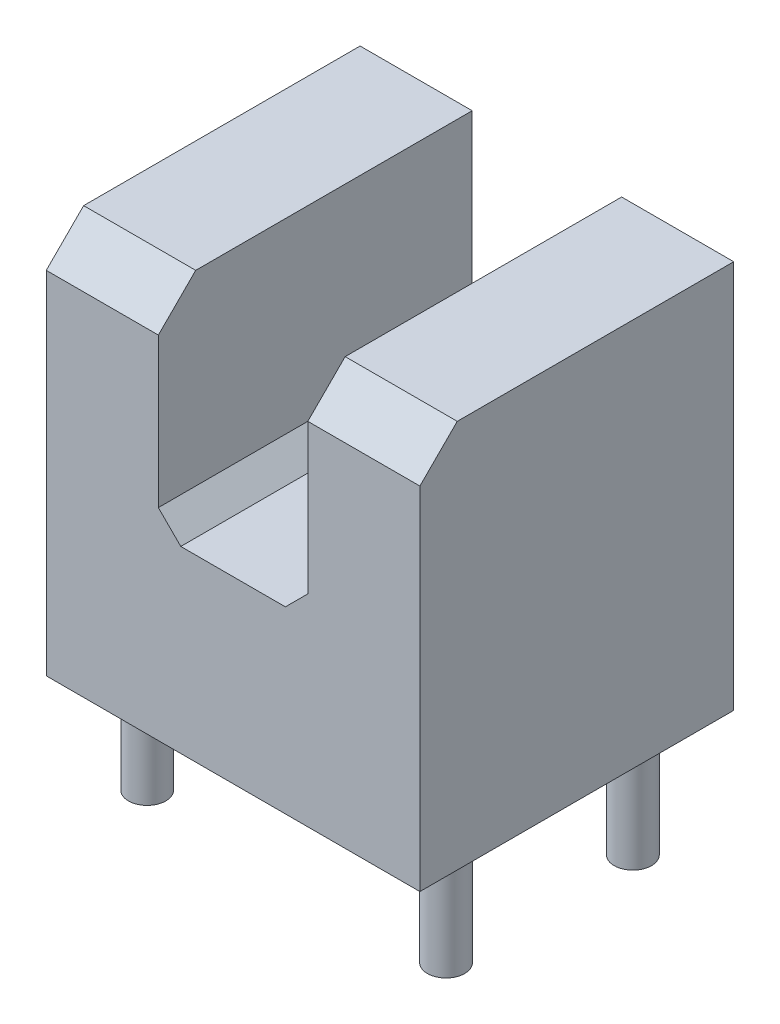
ISO-10303-21;
HEADER;
FILE_DESCRIPTION(('STEP AP214'),'2;1');
FILE_NAME('part.step','',(''),(''),'','','');
FILE_SCHEMA(('AUTOMOTIVE_DESIGN { 1 0 10303 214 1 1 1 1 }'));
ENDSEC;
DATA;
#1=APPLICATION_CONTEXT('core data for automotive mechanical design processes');
#2=APPLICATION_PROTOCOL_DEFINITION('international standard','automotive_design',2000,#1);
#3=PRODUCT_CONTEXT('',#1,'mechanical');
#4=PRODUCT('Part','Part','',(#3));
#5=PRODUCT_RELATED_PRODUCT_CATEGORY('part','',(#4));
#6=PRODUCT_DEFINITION_FORMATION('','',#4);
#7=PRODUCT_DEFINITION_CONTEXT('part definition',#1,'design');
#8=PRODUCT_DEFINITION('design','',#6,#7);
#9=PRODUCT_DEFINITION_SHAPE('','',#8);
#10=(LENGTH_UNIT() NAMED_UNIT(*) SI_UNIT(.MILLI.,.METRE.));
#11=(NAMED_UNIT(*) PLANE_ANGLE_UNIT() SI_UNIT($,.RADIAN.));
#12=(NAMED_UNIT(*) SI_UNIT($,.STERADIAN.) SOLID_ANGLE_UNIT());
#13=UNCERTAINTY_MEASURE_WITH_UNIT(LENGTH_MEASURE(1.E-05),#10,'distance_accuracy_value','');
#14=(GEOMETRIC_REPRESENTATION_CONTEXT(3) GLOBAL_UNCERTAINTY_ASSIGNED_CONTEXT((#13)) GLOBAL_UNIT_ASSIGNED_CONTEXT((#10,
#11,#12)) REPRESENTATION_CONTEXT('',''));
#15=CARTESIAN_POINT('',(0.,0.,0.));
#16=DIRECTION('',(0.,0.,1.));
#17=DIRECTION('',(1.,0.,0.));
#18=AXIS2_PLACEMENT_3D('',#15,#16,#17);
#19=CARTESIAN_POINT('',(0.,2.4,0.));
#20=DIRECTION('',(0.,-1.,0.));
#21=DIRECTION('',(0.,0.,-1.));
#22=AXIS2_PLACEMENT_3D('',#19,#20,#21);
#23=PLANE('',#22);
#24=DIRECTION('',(1.,0.,0.));
#25=VECTOR('',#24,1.);
#26=CARTESIAN_POINT('',(0.,2.4,2.1));
#27=LINE('',#26,#25);
#28=CARTESIAN_POINT('',(-0.7,2.4,2.1));
#29=VERTEX_POINT('',#28);
#30=CARTESIAN_POINT('',(0.7,2.4,2.1));
#31=VERTEX_POINT('',#30);
#32=EDGE_CURVE('E108',#29,#31,#27,.T.);
#33=ORIENTED_EDGE('',*,*,#32,.T.);
#34=DIRECTION('',(0.,0.,1.));
#35=VECTOR('',#34,1.);
#36=CARTESIAN_POINT('',(0.7,2.4,-2.1));
#37=LINE('',#36,#35);
#38=CARTESIAN_POINT('',(0.7,2.4,-2.1));
#39=VERTEX_POINT('',#38);
#40=EDGE_CURVE('E218',#39,#31,#37,.T.);
#41=ORIENTED_EDGE('',*,*,#40,.F.);
#42=DIRECTION('',(1.,0.,0.));
#43=VECTOR('',#42,1.);
#44=CARTESIAN_POINT('',(0.,2.4,-2.1));
#45=LINE('',#44,#43);
#46=CARTESIAN_POINT('',(-0.7,2.4,-2.1));
#47=VERTEX_POINT('',#46);
#48=EDGE_CURVE('E103',#39,#47,#45,.F.);
#49=ORIENTED_EDGE('',*,*,#48,.T.);
#50=DIRECTION('',(0.,0.,1.));
#51=VECTOR('',#50,1.);
#52=CARTESIAN_POINT('',(-0.7,2.4,-2.1));
#53=LINE('',#52,#51);
#54=EDGE_CURVE('E119',#29,#47,#53,.F.);
#55=ORIENTED_EDGE('',*,*,#54,.F.);
#56=EDGE_LOOP('',(#33,#41,#49,#55));
#57=FACE_BOUND('',#56,.T.);
#58=ADVANCED_FACE('F16',(#57),#23,.F.);
#59=CARTESIAN_POINT('',(-1.,2.7,-2.1));
#60=DIRECTION('',(0.707106781186548,0.707106781186548,0.));
#61=DIRECTION('',(-0.707106781186548,0.707106781186548,0.));
#62=AXIS2_PLACEMENT_3D('',#59,#60,#61);
#63=PLANE('',#62);
#64=DIRECTION('',(-0.707106781186548,0.707106781186548,0.));
#65=VECTOR('',#64,1.);
#66=CARTESIAN_POINT('',(-1.,2.7,-2.1));
#67=LINE('',#66,#65);
#68=CARTESIAN_POINT('',(-1.,2.7,-2.1));
#69=VERTEX_POINT('',#68);
#70=EDGE_CURVE('E121',#47,#69,#67,.T.);
#71=ORIENTED_EDGE('',*,*,#70,.T.);
#72=DIRECTION('',(0.,0.,1.));
#73=VECTOR('',#72,1.);
#74=CARTESIAN_POINT('',(-1.,2.7,-2.1));
#75=LINE('',#74,#73);
#76=CARTESIAN_POINT('',(-1.,2.7,2.1));
#77=VERTEX_POINT('',#76);
#78=EDGE_CURVE('E125',#77,#69,#75,.F.);
#79=ORIENTED_EDGE('',*,*,#78,.F.);
#80=DIRECTION('',(-0.707106781186548,0.707106781186548,0.));
#81=VECTOR('',#80,1.);
#82=CARTESIAN_POINT('',(-1.,2.7,2.1));
#83=LINE('',#82,#81);
#84=EDGE_CURVE('E112',#77,#29,#83,.F.);
#85=ORIENTED_EDGE('',*,*,#84,.T.);
#86=ORIENTED_EDGE('',*,*,#54,.T.);
#87=EDGE_LOOP('',(#71,#79,#85,#86));
#88=FACE_BOUND('',#87,.T.);
#89=ADVANCED_FACE('F123',(#88),#63,.T.);
#90=CARTESIAN_POINT('',(1.,2.7,-2.1));
#91=DIRECTION('',(-0.707106781186548,0.707106781186548,0.));
#92=DIRECTION('',(-0.707106781186548,-0.707106781186548,0.));
#93=AXIS2_PLACEMENT_3D('',#90,#91,#92);
#94=PLANE('',#93);
#95=DIRECTION('',(-0.707106781186548,-0.707106781186548,0.));
#96=VECTOR('',#95,1.);
#97=CARTESIAN_POINT('',(1.,2.7,2.1));
#98=LINE('',#97,#96);
#99=CARTESIAN_POINT('',(1.,2.7,2.1));
#100=VERTEX_POINT('',#99);
#101=EDGE_CURVE('E115',#31,#100,#98,.F.);
#102=ORIENTED_EDGE('',*,*,#101,.T.);
#103=DIRECTION('',(0.,0.,-1.));
#104=VECTOR('',#103,1.);
#105=CARTESIAN_POINT('',(1.,2.7,-2.1));
#106=LINE('',#105,#104);
#107=CARTESIAN_POINT('',(1.,2.7,-2.1));
#108=VERTEX_POINT('',#107);
#109=EDGE_CURVE('E192',#108,#100,#106,.F.);
#110=ORIENTED_EDGE('',*,*,#109,.F.);
#111=DIRECTION('',(-0.707106781186548,-0.707106781186548,0.));
#112=VECTOR('',#111,1.);
#113=CARTESIAN_POINT('',(1.,2.7,-2.1));
#114=LINE('',#113,#112);
#115=EDGE_CURVE('E220',#108,#39,#114,.T.);
#116=ORIENTED_EDGE('',*,*,#115,.T.);
#117=ORIENTED_EDGE('',*,*,#40,.T.);
#118=EDGE_LOOP('',(#102,#110,#116,#117));
#119=FACE_BOUND('',#118,.T.);
#120=ADVANCED_FACE('F260',(#119),#94,.T.);
#121=CARTESIAN_POINT('',(0.,5.2,0.));
#122=DIRECTION('',(0.,-1.,0.));
#123=DIRECTION('',(0.,0.,-1.));
#124=AXIS2_PLACEMENT_3D('',#121,#122,#123);
#125=PLANE('',#124);
#126=DIRECTION('',(0.,0.,1.));
#127=VECTOR('',#126,1.);
#128=CARTESIAN_POINT('',(2.5,5.2,2.1));
#129=LINE('',#128,#127);
#130=CARTESIAN_POINT('',(2.5,5.2,-2.1));
#131=VERTEX_POINT('',#130);
#132=CARTESIAN_POINT('',(2.5,5.2,1.6));
#133=VERTEX_POINT('',#132);
#134=EDGE_CURVE('E189',#131,#133,#129,.T.);
#135=ORIENTED_EDGE('',*,*,#134,.F.);
#136=DIRECTION('',(1.,0.,0.));
#137=VECTOR('',#136,1.);
#138=CARTESIAN_POINT('',(0.,5.2,-2.1));
#139=LINE('',#138,#137);
#140=CARTESIAN_POINT('',(1.,5.2,-2.1));
#141=VERTEX_POINT('',#140);
#142=EDGE_CURVE('E215',#131,#141,#139,.F.);
#143=ORIENTED_EDGE('',*,*,#142,.T.);
#144=DIRECTION('',(0.,0.,-1.));
#145=VECTOR('',#144,1.);
#146=CARTESIAN_POINT('',(1.,5.2,-2.1));
#147=LINE('',#146,#145);
#148=CARTESIAN_POINT('',(1.,5.2,1.6));
#149=VERTEX_POINT('',#148);
#150=EDGE_CURVE('E195',#149,#141,#147,.T.);
#151=ORIENTED_EDGE('',*,*,#150,.F.);
#152=DIRECTION('',(1.,0.,0.));
#153=VECTOR('',#152,1.);
#154=CARTESIAN_POINT('',(0.,5.2,1.6));
#155=LINE('',#154,#153);
#156=EDGE_CURVE('E213',#133,#149,#155,.F.);
#157=ORIENTED_EDGE('',*,*,#156,.F.);
#158=EDGE_LOOP('',(#135,#143,#151,#157));
#159=FACE_BOUND('',#158,.T.);
#160=ADVANCED_FACE('F262',(#159),#125,.F.);
#161=CARTESIAN_POINT('',(0.,5.2,1.6));
#162=DIRECTION('',(0.,-0.707106781186548,-0.707106781186548));
#163=DIRECTION('',(0.,0.707106781186548,-0.707106781186548));
#164=AXIS2_PLACEMENT_3D('',#161,#162,#163);
#165=PLANE('',#164);
#166=DIRECTION('',(0.,-0.707106781186548,0.707106781186547));
#167=VECTOR('',#166,1.);
#168=CARTESIAN_POINT('',(2.5,5.2,1.6));
#169=LINE('',#168,#167);
#170=CARTESIAN_POINT('',(2.5,4.7,2.1));
#171=VERTEX_POINT('',#170);
#172=EDGE_CURVE('E187',#133,#171,#169,.T.);
#173=ORIENTED_EDGE('',*,*,#172,.F.);
#174=ORIENTED_EDGE('',*,*,#156,.T.);
#175=DIRECTION('',(0.,0.707106781186547,-0.707106781186547));
#176=VECTOR('',#175,1.);
#177=CARTESIAN_POINT('',(1.,4.7,2.1));
#178=LINE('',#177,#176);
#179=CARTESIAN_POINT('',(1.,4.7,2.1));
#180=VERTEX_POINT('',#179);
#181=EDGE_CURVE('E198',#180,#149,#178,.T.);
#182=ORIENTED_EDGE('',*,*,#181,.F.);
#183=DIRECTION('',(-1.,0.,0.));
#184=VECTOR('',#183,1.);
#185=CARTESIAN_POINT('',(-2.5,4.7,2.1));
#186=LINE('',#185,#184);
#187=EDGE_CURVE('E181',#171,#180,#186,.T.);
#188=ORIENTED_EDGE('',*,*,#187,.F.);
#189=EDGE_LOOP('',(#173,#174,#182,#188));
#190=FACE_BOUND('',#189,.T.);
#191=ADVANCED_FACE('F252',(#190),#165,.F.);
#192=CARTESIAN_POINT('',(0.,5.2,1.6));
#193=DIRECTION('',(0.,0.707106781186548,0.707106781186548));
#194=DIRECTION('',(0.,-0.707106781186548,0.707106781186548));
#195=AXIS2_PLACEMENT_3D('',#192,#193,#194);
#196=PLANE('',#195);
#197=DIRECTION('',(0.,-0.707106781186547,0.707106781186547));
#198=VECTOR('',#197,1.);
#199=CARTESIAN_POINT('',(-1.,5.2,1.6));
#200=LINE('',#199,#198);
#201=CARTESIAN_POINT('',(-1.,5.2,1.6));
#202=VERTEX_POINT('',#201);
#203=CARTESIAN_POINT('',(-1.,4.7,2.1));
#204=VERTEX_POINT('',#203);
#205=EDGE_CURVE('E202',#202,#204,#200,.T.);
#206=ORIENTED_EDGE('',*,*,#205,.F.);
#207=DIRECTION('',(1.,0.,0.));
#208=VECTOR('',#207,1.);
#209=CARTESIAN_POINT('',(0.,5.2,1.6));
#210=LINE('',#209,#208);
#211=CARTESIAN_POINT('',(-2.5,5.2,1.6));
#212=VERTEX_POINT('',#211);
#213=EDGE_CURVE('E209',#212,#202,#210,.T.);
#214=ORIENTED_EDGE('',*,*,#213,.F.);
#215=DIRECTION('',(0.,-0.707106781186548,0.707106781186548));
#216=VECTOR('',#215,1.);
#217=CARTESIAN_POINT('',(-2.5,5.2,1.6));
#218=LINE('',#217,#216);
#219=CARTESIAN_POINT('',(-2.5,4.7,2.1));
#220=VERTEX_POINT('',#219);
#221=EDGE_CURVE('E211',#212,#220,#218,.T.);
#222=ORIENTED_EDGE('',*,*,#221,.T.);
#223=DIRECTION('',(-1.,0.,0.));
#224=VECTOR('',#223,1.);
#225=CARTESIAN_POINT('',(-2.5,4.7,2.1));
#226=LINE('',#225,#224);
#227=EDGE_CURVE('E174',#204,#220,#226,.T.);
#228=ORIENTED_EDGE('',*,*,#227,.F.);
#229=EDGE_LOOP('',(#206,#214,#222,#228));
#230=FACE_BOUND('',#229,.T.);
#231=ADVANCED_FACE('F234',(#230),#196,.T.);
#232=CARTESIAN_POINT('',(0.,5.2,0.));
#233=DIRECTION('',(0.,1.,0.));
#234=DIRECTION('',(0.,0.,1.));
#235=AXIS2_PLACEMENT_3D('',#232,#233,#234);
#236=PLANE('',#235);
#237=DIRECTION('',(0.,0.,1.));
#238=VECTOR('',#237,1.);
#239=CARTESIAN_POINT('',(-1.,5.2,-2.1));
#240=LINE('',#239,#238);
#241=CARTESIAN_POINT('',(-1.,5.2,-2.1));
#242=VERTEX_POINT('',#241);
#243=EDGE_CURVE('E204',#242,#202,#240,.T.);
#244=ORIENTED_EDGE('',*,*,#243,.F.);
#245=DIRECTION('',(1.,0.,0.));
#246=VECTOR('',#245,1.);
#247=CARTESIAN_POINT('',(0.,5.2,-2.1));
#248=LINE('',#247,#246);
#249=CARTESIAN_POINT('',(-2.5,5.2,-2.1));
#250=VERTEX_POINT('',#249);
#251=EDGE_CURVE('E207',#242,#250,#248,.F.);
#252=ORIENTED_EDGE('',*,*,#251,.T.);
#253=DIRECTION('',(0.,0.,-1.));
#254=VECTOR('',#253,1.);
#255=CARTESIAN_POINT('',(-2.5,5.2,2.1));
#256=LINE('',#255,#254);
#257=EDGE_CURVE('E169',#212,#250,#256,.T.);
#258=ORIENTED_EDGE('',*,*,#257,.F.);
#259=ORIENTED_EDGE('',*,*,#213,.T.);
#260=EDGE_LOOP('',(#244,#252,#258,#259));
#261=FACE_BOUND('',#260,.T.);
#262=ADVANCED_FACE('F229',(#261),#236,.T.);
#263=CARTESIAN_POINT('',(-1.,5.2,-2.1));
#264=DIRECTION('',(-1.,0.,0.));
#265=DIRECTION('',(0.,0.,1.));
#266=AXIS2_PLACEMENT_3D('',#263,#264,#265);
#267=PLANE('',#266);
#268=ORIENTED_EDGE('',*,*,#78,.T.);
#269=DIRECTION('',(0.,1.,0.));
#270=VECTOR('',#269,1.);
#271=CARTESIAN_POINT('',(-1.,2.4,-2.1));
#272=LINE('',#271,#270);
#273=EDGE_CURVE('E161',#242,#69,#272,.F.);
#274=ORIENTED_EDGE('',*,*,#273,.F.);
#275=ORIENTED_EDGE('',*,*,#243,.T.);
#276=ORIENTED_EDGE('',*,*,#205,.T.);
#277=DIRECTION('',(0.,1.,0.));
#278=VECTOR('',#277,1.);
#279=CARTESIAN_POINT('',(-1.,2.4,2.1));
#280=LINE('',#279,#278);
#281=EDGE_CURVE('E177',#77,#204,#280,.T.);
#282=ORIENTED_EDGE('',*,*,#281,.F.);
#283=EDGE_LOOP('',(#268,#274,#275,#276,#282));
#284=FACE_BOUND('',#283,.T.);
#285=ADVANCED_FACE('F224',(#284),#267,.F.);
#286=CARTESIAN_POINT('',(1.,5.2,-2.1));
#287=DIRECTION('',(1.,0.,0.));
#288=DIRECTION('',(0.,0.,-1.));
#289=AXIS2_PLACEMENT_3D('',#286,#287,#288);
#290=PLANE('',#289);
#291=DIRECTION('',(0.,1.,0.));
#292=VECTOR('',#291,1.);
#293=CARTESIAN_POINT('',(1.,2.4,-2.1));
#294=LINE('',#293,#292);
#295=EDGE_CURVE('E155',#108,#141,#294,.T.);
#296=ORIENTED_EDGE('',*,*,#295,.F.);
#297=ORIENTED_EDGE('',*,*,#109,.T.);
#298=DIRECTION('',(0.,1.,0.));
#299=VECTOR('',#298,1.);
#300=CARTESIAN_POINT('',(1.,2.4,2.1));
#301=LINE('',#300,#299);
#302=EDGE_CURVE('E179',#180,#100,#301,.F.);
#303=ORIENTED_EDGE('',*,*,#302,.F.);
#304=ORIENTED_EDGE('',*,*,#181,.T.);
#305=ORIENTED_EDGE('',*,*,#150,.T.);
#306=EDGE_LOOP('',(#296,#297,#303,#304,#305));
#307=FACE_BOUND('',#306,.T.);
#308=ADVANCED_FACE('F257',(#307),#290,.F.);
#309=CARTESIAN_POINT('',(2.,-1.5,-1.25));
#310=DIRECTION('',(0.,-1.,0.));
#311=DIRECTION('',(0.,0.,-1.));
#312=AXIS2_PLACEMENT_3D('',#309,#310,#311);
#313=PLANE('',#312);
#314=CARTESIAN_POINT('',(2.,-1.5,-1.25));
#315=DIRECTION('',(0.,1.,0.));
#316=DIRECTION('',(0.,0.,1.));
#317=AXIS2_PLACEMENT_3D('',#314,#315,#316);
#318=CIRCLE('',#317,0.25);
#319=CARTESIAN_POINT('',(2.,-1.5,-1.));
#320=VERTEX_POINT('',#319);
#321=EDGE_CURVE('E19',#320,#320,#318,.T.);
#322=ORIENTED_EDGE('',*,*,#321,.F.);
#323=EDGE_LOOP('',(#322));
#324=FACE_BOUND('',#323,.T.);
#325=ADVANCED_FACE('F314',(#324),#313,.T.);
#326=CARTESIAN_POINT('',(2.,-1.5,1.25));
#327=DIRECTION('',(0.,-1.,0.));
#328=DIRECTION('',(0.,0.,-1.));
#329=AXIS2_PLACEMENT_3D('',#326,#327,#328);
#330=PLANE('',#329);
#331=CARTESIAN_POINT('',(2.,-1.5,1.25));
#332=DIRECTION('',(0.,1.,0.));
#333=DIRECTION('',(0.,0.,1.));
#334=AXIS2_PLACEMENT_3D('',#331,#332,#333);
#335=CIRCLE('',#334,0.25);
#336=CARTESIAN_POINT('',(2.,-1.5,1.5));
#337=VERTEX_POINT('',#336);
#338=EDGE_CURVE('E146',#337,#337,#335,.T.);
#339=ORIENTED_EDGE('',*,*,#338,.F.);
#340=EDGE_LOOP('',(#339));
#341=FACE_BOUND('',#340,.T.);
#342=ADVANCED_FACE('F310',(#341),#330,.T.);
#343=CARTESIAN_POINT('',(-2.,-1.5,1.25));
#344=DIRECTION('',(0.,-1.,0.));
#345=DIRECTION('',(0.,0.,-1.));
#346=AXIS2_PLACEMENT_3D('',#343,#344,#345);
#347=PLANE('',#346);
#348=CARTESIAN_POINT('',(-2.,-1.5,1.25));
#349=DIRECTION('',(0.,1.,0.));
#350=DIRECTION('',(0.,0.,1.));
#351=AXIS2_PLACEMENT_3D('',#348,#349,#350);
#352=CIRCLE('',#351,0.25);
#353=CARTESIAN_POINT('',(-2.,-1.5,1.5));
#354=VERTEX_POINT('',#353);
#355=EDGE_CURVE('E143',#354,#354,#352,.T.);
#356=ORIENTED_EDGE('',*,*,#355,.F.);
#357=EDGE_LOOP('',(#356));
#358=FACE_BOUND('',#357,.T.);
#359=ADVANCED_FACE('F307',(#358),#347,.T.);
#360=CARTESIAN_POINT('',(2.5,2.4,2.1));
#361=DIRECTION('',(-1.,0.,0.));
#362=DIRECTION('',(0.,0.,1.));
#363=AXIS2_PLACEMENT_3D('',#360,#361,#362);
#364=PLANE('',#363);
#365=DIRECTION('',(0.,0.,-1.));
#366=VECTOR('',#365,1.);
#367=CARTESIAN_POINT('',(2.5,0.,0.));
#368=LINE('',#367,#366);
#369=CARTESIAN_POINT('',(2.5,0.,-2.1));
#370=VERTEX_POINT('',#369);
#371=CARTESIAN_POINT('',(2.5,0.,2.1));
#372=VERTEX_POINT('',#371);
#373=EDGE_CURVE('E145',#370,#372,#368,.F.);
#374=ORIENTED_EDGE('',*,*,#373,.F.);
#375=DIRECTION('',(0.,1.,0.));
#376=VECTOR('',#375,1.);
#377=CARTESIAN_POINT('',(2.5,2.4,-2.1));
#378=LINE('',#377,#376);
#379=EDGE_CURVE('E151',#131,#370,#378,.F.);
#380=ORIENTED_EDGE('',*,*,#379,.F.);
#381=ORIENTED_EDGE('',*,*,#134,.T.);
#382=ORIENTED_EDGE('',*,*,#172,.T.);
#383=DIRECTION('',(0.,1.,0.));
#384=VECTOR('',#383,1.);
#385=CARTESIAN_POINT('',(2.5,2.4,2.1));
#386=LINE('',#385,#384);
#387=EDGE_CURVE('E184',#372,#171,#386,.T.);
#388=ORIENTED_EDGE('',*,*,#387,.F.);
#389=EDGE_LOOP('',(#374,#380,#381,#382,#388));
#390=FACE_BOUND('',#389,.T.);
#391=ADVANCED_FACE('F248',(#390),#364,.F.);
#392=CARTESIAN_POINT('',(-2.5,2.4,2.1));
#393=DIRECTION('',(0.,0.,-1.));
#394=DIRECTION('',(-1.,0.,0.));
#395=AXIS2_PLACEMENT_3D('',#392,#393,#394);
#396=PLANE('',#395);
#397=DIRECTION('',(0.,1.,0.));
#398=VECTOR('',#397,1.);
#399=CARTESIAN_POINT('',(-2.5,2.4,2.1));
#400=LINE('',#399,#398);
#401=CARTESIAN_POINT('',(-2.5,0.,2.1));
#402=VERTEX_POINT('',#401);
#403=EDGE_CURVE('E171',#402,#220,#400,.T.);
#404=ORIENTED_EDGE('',*,*,#403,.F.);
#405=DIRECTION('',(1.,0.,0.));
#406=VECTOR('',#405,1.);
#407=CARTESIAN_POINT('',(0.,0.,2.1));
#408=LINE('',#407,#406);
#409=EDGE_CURVE('E241',#372,#402,#408,.F.);
#410=ORIENTED_EDGE('',*,*,#409,.F.);
#411=ORIENTED_EDGE('',*,*,#387,.T.);
#412=ORIENTED_EDGE('',*,*,#187,.T.);
#413=ORIENTED_EDGE('',*,*,#302,.T.);
#414=ORIENTED_EDGE('',*,*,#101,.F.);
#415=ORIENTED_EDGE('',*,*,#32,.F.);
#416=ORIENTED_EDGE('',*,*,#84,.F.);
#417=ORIENTED_EDGE('',*,*,#281,.T.);
#418=ORIENTED_EDGE('',*,*,#227,.T.);
#419=EDGE_LOOP('',(#404,#410,#411,#412,#413,#414,#415,#416,#417,#418));
#420=FACE_BOUND('',#419,.T.);
#421=ADVANCED_FACE('F109',(#420),#396,.F.);
#422=CARTESIAN_POINT('',(-2.5,2.4,2.1));
#423=DIRECTION('',(1.,0.,0.));
#424=DIRECTION('',(0.,0.,-1.));
#425=AXIS2_PLACEMENT_3D('',#422,#423,#424);
#426=PLANE('',#425);
#427=DIRECTION('',(0.,1.,0.));
#428=VECTOR('',#427,1.);
#429=CARTESIAN_POINT('',(-2.5,2.4,-2.1));
#430=LINE('',#429,#428);
#431=CARTESIAN_POINT('',(-2.5,0.,-2.1));
#432=VERTEX_POINT('',#431);
#433=EDGE_CURVE('E34',#432,#250,#430,.T.);
#434=ORIENTED_EDGE('',*,*,#433,.F.);
#435=DIRECTION('',(0.,0.,-1.));
#436=VECTOR('',#435,1.);
#437=CARTESIAN_POINT('',(-2.5,0.,0.));
#438=LINE('',#437,#436);
#439=EDGE_CURVE('E238',#402,#432,#438,.T.);
#440=ORIENTED_EDGE('',*,*,#439,.F.);
#441=ORIENTED_EDGE('',*,*,#403,.T.);
#442=ORIENTED_EDGE('',*,*,#221,.F.);
#443=ORIENTED_EDGE('',*,*,#257,.T.);
#444=EDGE_LOOP('',(#434,#440,#441,#442,#443));
#445=FACE_BOUND('',#444,.T.);
#446=ADVANCED_FACE('F236',(#445),#426,.F.);
#447=CARTESIAN_POINT('',(-2.5,2.4,-2.1));
#448=DIRECTION('',(0.,0.,1.));
#449=DIRECTION('',(1.,0.,0.));
#450=AXIS2_PLACEMENT_3D('',#447,#448,#449);
#451=PLANE('',#450);
#452=ORIENTED_EDGE('',*,*,#142,.F.);
#453=ORIENTED_EDGE('',*,*,#379,.T.);
#454=DIRECTION('',(1.,0.,0.));
#455=VECTOR('',#454,1.);
#456=CARTESIAN_POINT('',(0.,0.,-2.1));
#457=LINE('',#456,#455);
#458=EDGE_CURVE('E142',#432,#370,#457,.T.);
#459=ORIENTED_EDGE('',*,*,#458,.F.);
#460=ORIENTED_EDGE('',*,*,#433,.T.);
#461=ORIENTED_EDGE('',*,*,#251,.F.);
#462=ORIENTED_EDGE('',*,*,#273,.T.);
#463=ORIENTED_EDGE('',*,*,#70,.F.);
#464=ORIENTED_EDGE('',*,*,#48,.F.);
#465=ORIENTED_EDGE('',*,*,#115,.F.);
#466=ORIENTED_EDGE('',*,*,#295,.T.);
#467=EDGE_LOOP('',(#452,#453,#459,#460,#461,#462,#463,#464,#465,#466));
#468=FACE_BOUND('',#467,.T.);
#469=ADVANCED_FACE('F225',(#468),#451,.F.);
#470=CARTESIAN_POINT('',(2.,0.,-1.25));
#471=DIRECTION('',(0.,1.,0.));
#472=DIRECTION('',(0.,0.,1.));
#473=AXIS2_PLACEMENT_3D('',#470,#471,#472);
#474=CYLINDRICAL_SURFACE('',#473,0.25);
#475=CARTESIAN_POINT('',(2.,0.,-1.25));
#476=DIRECTION('',(0.,1.,0.));
#477=DIRECTION('',(0.,0.,1.));
#478=AXIS2_PLACEMENT_3D('',#475,#476,#477);
#479=CIRCLE('',#478,0.25);
#480=CARTESIAN_POINT('',(2.,0.,-1.));
#481=VERTEX_POINT('',#480);
#482=EDGE_CURVE('E139',#481,#481,#479,.T.);
#483=ORIENTED_EDGE('',*,*,#482,.F.);
#484=EDGE_LOOP('',(#483));
#485=FACE_BOUND('',#484,.T.);
#486=ORIENTED_EDGE('',*,*,#321,.T.);
#487=EDGE_LOOP('',(#486));
#488=FACE_BOUND('',#487,.T.);
#489=ADVANCED_FACE('F294',(#485,#488),#474,.T.);
#490=CARTESIAN_POINT('',(2.,0.,1.25));
#491=DIRECTION('',(0.,1.,0.));
#492=DIRECTION('',(0.,0.,1.));
#493=AXIS2_PLACEMENT_3D('',#490,#491,#492);
#494=CYLINDRICAL_SURFACE('',#493,0.25);
#495=CARTESIAN_POINT('',(2.,0.,1.25));
#496=DIRECTION('',(0.,1.,0.));
#497=DIRECTION('',(0.,0.,1.));
#498=AXIS2_PLACEMENT_3D('',#495,#496,#497);
#499=CIRCLE('',#498,0.25);
#500=CARTESIAN_POINT('',(2.,0.,1.5));
#501=VERTEX_POINT('',#500);
#502=EDGE_CURVE('E136',#501,#501,#499,.T.);
#503=ORIENTED_EDGE('',*,*,#502,.F.);
#504=EDGE_LOOP('',(#503));
#505=FACE_BOUND('',#504,.T.);
#506=ORIENTED_EDGE('',*,*,#338,.T.);
#507=EDGE_LOOP('',(#506));
#508=FACE_BOUND('',#507,.T.);
#509=ADVANCED_FACE('F290',(#505,#508),#494,.T.);
#510=CARTESIAN_POINT('',(-2.,0.,1.25));
#511=DIRECTION('',(0.,1.,0.));
#512=DIRECTION('',(0.,0.,1.));
#513=AXIS2_PLACEMENT_3D('',#510,#511,#512);
#514=CYLINDRICAL_SURFACE('',#513,0.25);
#515=CARTESIAN_POINT('',(-2.,0.,1.25));
#516=DIRECTION('',(0.,1.,0.));
#517=DIRECTION('',(0.,0.,1.));
#518=AXIS2_PLACEMENT_3D('',#515,#516,#517);
#519=CIRCLE('',#518,0.25);
#520=CARTESIAN_POINT('',(-2.,0.,1.5));
#521=VERTEX_POINT('',#520);
#522=EDGE_CURVE('E133',#521,#521,#519,.T.);
#523=ORIENTED_EDGE('',*,*,#522,.F.);
#524=EDGE_LOOP('',(#523));
#525=FACE_BOUND('',#524,.T.);
#526=ORIENTED_EDGE('',*,*,#355,.T.);
#527=EDGE_LOOP('',(#526));
#528=FACE_BOUND('',#527,.T.);
#529=ADVANCED_FACE('F286',(#525,#528),#514,.T.);
#530=CARTESIAN_POINT('',(-2.,-1.5,-1.25));
#531=DIRECTION('',(0.,-1.,0.));
#532=DIRECTION('',(0.,0.,-1.));
#533=AXIS2_PLACEMENT_3D('',#530,#531,#532);
#534=PLANE('',#533);
#535=CARTESIAN_POINT('',(-2.,-1.5,-1.25));
#536=DIRECTION('',(0.,1.,0.));
#537=DIRECTION('',(0.,0.,1.));
#538=AXIS2_PLACEMENT_3D('',#535,#536,#537);
#539=CIRCLE('',#538,0.25);
#540=CARTESIAN_POINT('',(-2.,-1.5,-1.));
#541=VERTEX_POINT('',#540);
#542=EDGE_CURVE('E25',#541,#541,#539,.T.);
#543=ORIENTED_EDGE('',*,*,#542,.F.);
#544=EDGE_LOOP('',(#543));
#545=FACE_BOUND('',#544,.T.);
#546=ADVANCED_FACE('F279',(#545),#534,.T.);
#547=CARTESIAN_POINT('',(0.,0.,0.));
#548=DIRECTION('',(0.,-1.,0.));
#549=DIRECTION('',(0.,0.,-1.));
#550=AXIS2_PLACEMENT_3D('',#547,#548,#549);
#551=PLANE('',#550);
#552=ORIENTED_EDGE('',*,*,#522,.T.);
#553=EDGE_LOOP('',(#552));
#554=FACE_BOUND('',#553,.T.);
#555=ORIENTED_EDGE('',*,*,#502,.T.);
#556=EDGE_LOOP('',(#555));
#557=FACE_BOUND('',#556,.T.);
#558=ORIENTED_EDGE('',*,*,#482,.T.);
#559=EDGE_LOOP('',(#558));
#560=FACE_BOUND('',#559,.T.);
#561=CARTESIAN_POINT('',(-2.,0.,-1.25));
#562=DIRECTION('',(0.,1.,0.));
#563=DIRECTION('',(0.,0.,1.));
#564=AXIS2_PLACEMENT_3D('',#561,#562,#563);
#565=CIRCLE('',#564,0.25);
#566=CARTESIAN_POINT('',(-2.,0.,-1.));
#567=VERTEX_POINT('',#566);
#568=EDGE_CURVE('E11',#567,#567,#565,.F.);
#569=ORIENTED_EDGE('',*,*,#568,.F.);
#570=EDGE_LOOP('',(#569));
#571=FACE_BOUND('',#570,.T.);
#572=ORIENTED_EDGE('',*,*,#439,.T.);
#573=ORIENTED_EDGE('',*,*,#458,.T.);
#574=ORIENTED_EDGE('',*,*,#373,.T.);
#575=ORIENTED_EDGE('',*,*,#409,.T.);
#576=EDGE_LOOP('',(#572,#573,#574,#575));
#577=FACE_BOUND('',#576,.T.);
#578=ADVANCED_FACE('F244',(#554,#557,#560,#571,#577),#551,.T.);
#579=CARTESIAN_POINT('',(-2.,0.,-1.25));
#580=DIRECTION('',(0.,1.,0.));
#581=DIRECTION('',(0.,0.,1.));
#582=AXIS2_PLACEMENT_3D('',#579,#580,#581);
#583=CYLINDRICAL_SURFACE('',#582,0.25);
#584=ORIENTED_EDGE('',*,*,#568,.T.);
#585=EDGE_LOOP('',(#584));
#586=FACE_BOUND('',#585,.T.);
#587=ORIENTED_EDGE('',*,*,#542,.T.);
#588=EDGE_LOOP('',(#587));
#589=FACE_BOUND('',#588,.T.);
#590=ADVANCED_FACE('F272',(#586,#589),#583,.T.);
#591=CLOSED_SHELL('',(#58,#89,#120,#160,#191,#231,#262,#285,#308,#325,#342,#359,#391,#421,#446,
#469,#489,#509,#529,#546,#578,#590));
#592=MANIFOLD_SOLID_BREP('B1',#591);
#593=ADVANCED_BREP_SHAPE_REPRESENTATION('',(#18,#592),#14);
#594=SHAPE_DEFINITION_REPRESENTATION(#9,#593);
ENDSEC;
END-ISO-10303-21;
